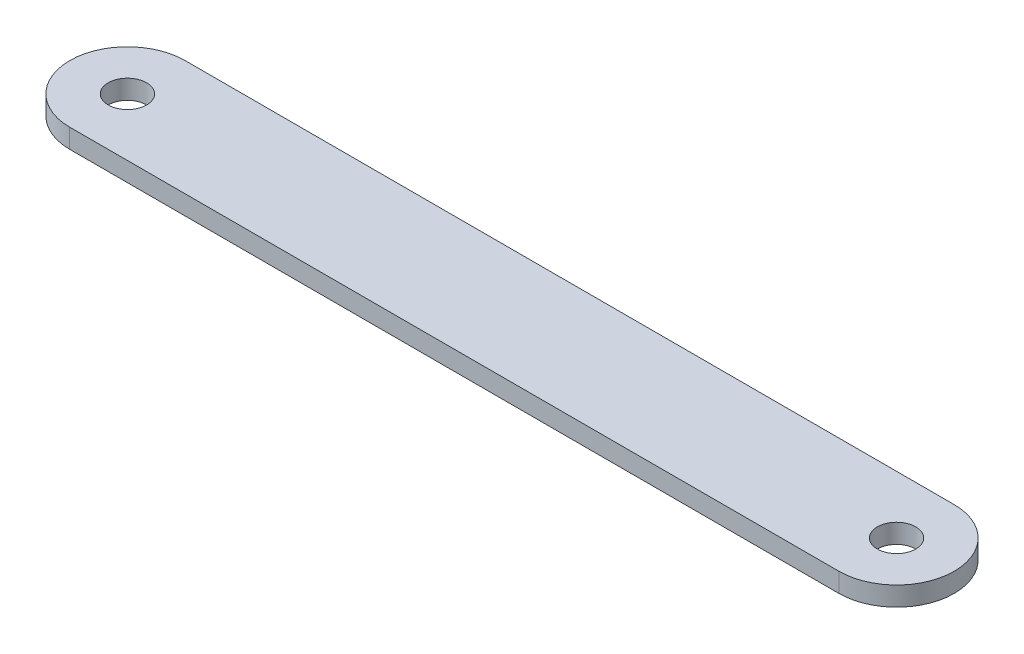
ISO-10303-21;
HEADER;
FILE_DESCRIPTION(('STEP AP214'),'2;1');
FILE_NAME('part.step','',(''),(''),'','','');
FILE_SCHEMA(('AUTOMOTIVE_DESIGN { 1 0 10303 214 1 1 1 1 }'));
ENDSEC;
DATA;
#1=APPLICATION_CONTEXT('core data for automotive mechanical design processes');
#2=APPLICATION_PROTOCOL_DEFINITION('international standard','automotive_design',2000,#1);
#3=PRODUCT_CONTEXT('',#1,'mechanical');
#4=PRODUCT('Part','Part','',(#3));
#5=PRODUCT_RELATED_PRODUCT_CATEGORY('part','',(#4));
#6=PRODUCT_DEFINITION_FORMATION('','',#4);
#7=PRODUCT_DEFINITION_CONTEXT('part definition',#1,'design');
#8=PRODUCT_DEFINITION('design','',#6,#7);
#9=PRODUCT_DEFINITION_SHAPE('','',#8);
#10=(LENGTH_UNIT() NAMED_UNIT(*) SI_UNIT(.MILLI.,.METRE.));
#11=(NAMED_UNIT(*) PLANE_ANGLE_UNIT() SI_UNIT($,.RADIAN.));
#12=(NAMED_UNIT(*) SI_UNIT($,.STERADIAN.) SOLID_ANGLE_UNIT());
#13=UNCERTAINTY_MEASURE_WITH_UNIT(LENGTH_MEASURE(1.E-05),#10,'distance_accuracy_value','');
#14=(GEOMETRIC_REPRESENTATION_CONTEXT(3) GLOBAL_UNCERTAINTY_ASSIGNED_CONTEXT((#13)) GLOBAL_UNIT_ASSIGNED_CONTEXT((#10,
#11,#12)) REPRESENTATION_CONTEXT('',''));
#15=CARTESIAN_POINT('',(0.,0.,0.));
#16=DIRECTION('',(0.,0.,1.));
#17=DIRECTION('',(1.,0.,0.));
#18=AXIS2_PLACEMENT_3D('',#15,#16,#17);
#19=CARTESIAN_POINT('',(0.,5.,0.));
#20=DIRECTION('',(0.,1.,0.));
#21=DIRECTION('',(0.,0.,1.));
#22=AXIS2_PLACEMENT_3D('',#19,#20,#21);
#23=PLANE('',#22);
#24=CARTESIAN_POINT('',(0.,5.,0.));
#25=DIRECTION('',(0.,1.,0.));
#26=DIRECTION('',(0.,0.,1.));
#27=AXIS2_PLACEMENT_3D('',#24,#25,#26);
#28=CIRCLE('',#27,5.);
#29=CARTESIAN_POINT('',(0.,5.,5.));
#30=VERTEX_POINT('',#29);
#31=EDGE_CURVE('E106',#30,#30,#28,.T.);
#32=ORIENTED_EDGE('',*,*,#31,.F.);
#33=EDGE_LOOP('',(#32));
#34=FACE_BOUND('',#33,.T.);
#35=CARTESIAN_POINT('',(0.,5.,0.));
#36=DIRECTION('',(0.,1.,0.));
#37=DIRECTION('',(0.,0.,1.));
#38=AXIS2_PLACEMENT_3D('',#35,#36,#37);
#39=CIRCLE('',#38,15.);
#40=CARTESIAN_POINT('',(0.,5.,-15.));
#41=VERTEX_POINT('',#40);
#42=CARTESIAN_POINT('',(0.,5.,15.));
#43=VERTEX_POINT('',#42);
#44=EDGE_CURVE('E91',#41,#43,#39,.T.);
#45=ORIENTED_EDGE('',*,*,#44,.T.);
#46=DIRECTION('',(1.,0.,0.));
#47=VECTOR('',#46,1.);
#48=CARTESIAN_POINT('',(0.,5.,15.));
#49=LINE('',#48,#47);
#50=CARTESIAN_POINT('',(200.,5.,15.));
#51=VERTEX_POINT('',#50);
#52=EDGE_CURVE('E86',#43,#51,#49,.T.);
#53=ORIENTED_EDGE('',*,*,#52,.T.);
#54=CARTESIAN_POINT('',(200.,5.,0.));
#55=DIRECTION('',(0.,1.,0.));
#56=DIRECTION('',(0.,0.,1.));
#57=AXIS2_PLACEMENT_3D('',#54,#55,#56);
#58=CIRCLE('',#57,15.);
#59=CARTESIAN_POINT('',(200.,5.,-15.));
#60=VERTEX_POINT('',#59);
#61=EDGE_CURVE('E89',#51,#60,#58,.T.);
#62=ORIENTED_EDGE('',*,*,#61,.T.);
#63=DIRECTION('',(-1.,0.,0.));
#64=VECTOR('',#63,1.);
#65=CARTESIAN_POINT('',(0.,5.,-15.));
#66=LINE('',#65,#64);
#67=EDGE_CURVE('E56',#60,#41,#66,.T.);
#68=ORIENTED_EDGE('',*,*,#67,.T.);
#69=EDGE_LOOP('',(#45,#53,#62,#68));
#70=FACE_BOUND('',#69,.T.);
#71=CARTESIAN_POINT('',(200.,5.,0.));
#72=DIRECTION('',(0.,1.,0.));
#73=DIRECTION('',(0.,0.,1.));
#74=AXIS2_PLACEMENT_3D('',#71,#72,#73);
#75=CIRCLE('',#74,4.99999999999999);
#76=CARTESIAN_POINT('',(200.,5.,4.99999999999999));
#77=VERTEX_POINT('',#76);
#78=EDGE_CURVE('E121',#77,#77,#75,.T.);
#79=ORIENTED_EDGE('',*,*,#78,.F.);
#80=EDGE_LOOP('',(#79));
#81=FACE_BOUND('',#80,.T.);
#82=ADVANCED_FACE('F39',(#34,#70,#81),#23,.T.);
#83=CARTESIAN_POINT('',(0.,0.,0.));
#84=DIRECTION('',(0.,1.,0.));
#85=DIRECTION('',(0.,0.,1.));
#86=AXIS2_PLACEMENT_3D('',#83,#84,#85);
#87=PLANE('',#86);
#88=CARTESIAN_POINT('',(0.,0.,0.));
#89=DIRECTION('',(0.,1.,0.));
#90=DIRECTION('',(0.,0.,1.));
#91=AXIS2_PLACEMENT_3D('',#88,#89,#90);
#92=CIRCLE('',#91,15.);
#93=CARTESIAN_POINT('',(0.,0.,-15.));
#94=VERTEX_POINT('',#93);
#95=CARTESIAN_POINT('',(0.,0.,15.));
#96=VERTEX_POINT('',#95);
#97=EDGE_CURVE('E103',#94,#96,#92,.T.);
#98=ORIENTED_EDGE('',*,*,#97,.F.);
#99=DIRECTION('',(-1.,0.,0.));
#100=VECTOR('',#99,1.);
#101=CARTESIAN_POINT('',(0.,0.,-15.));
#102=LINE('',#101,#100);
#103=CARTESIAN_POINT('',(200.,0.,-15.));
#104=VERTEX_POINT('',#103);
#105=EDGE_CURVE('E79',#104,#94,#102,.T.);
#106=ORIENTED_EDGE('',*,*,#105,.F.);
#107=CARTESIAN_POINT('',(200.,0.,0.));
#108=DIRECTION('',(0.,1.,0.));
#109=DIRECTION('',(0.,0.,1.));
#110=AXIS2_PLACEMENT_3D('',#107,#108,#109);
#111=CIRCLE('',#110,15.);
#112=CARTESIAN_POINT('',(200.,0.,15.));
#113=VERTEX_POINT('',#112);
#114=EDGE_CURVE('E73',#113,#104,#111,.T.);
#115=ORIENTED_EDGE('',*,*,#114,.F.);
#116=DIRECTION('',(1.,0.,0.));
#117=VECTOR('',#116,1.);
#118=CARTESIAN_POINT('',(0.,0.,15.));
#119=LINE('',#118,#117);
#120=EDGE_CURVE('E95',#96,#113,#119,.T.);
#121=ORIENTED_EDGE('',*,*,#120,.F.);
#122=EDGE_LOOP('',(#98,#106,#115,#121));
#123=FACE_BOUND('',#122,.T.);
#124=CARTESIAN_POINT('',(0.,0.,0.));
#125=DIRECTION('',(0.,1.,0.));
#126=DIRECTION('',(0.,0.,1.));
#127=AXIS2_PLACEMENT_3D('',#124,#125,#126);
#128=CIRCLE('',#127,5.);
#129=CARTESIAN_POINT('',(0.,0.,5.));
#130=VERTEX_POINT('',#129);
#131=EDGE_CURVE('E118',#130,#130,#128,.T.);
#132=ORIENTED_EDGE('',*,*,#131,.T.);
#133=EDGE_LOOP('',(#132));
#134=FACE_BOUND('',#133,.T.);
#135=CARTESIAN_POINT('',(200.,0.,0.));
#136=DIRECTION('',(0.,1.,0.));
#137=DIRECTION('',(0.,0.,1.));
#138=AXIS2_PLACEMENT_3D('',#135,#136,#137);
#139=CIRCLE('',#138,4.99999999999999);
#140=CARTESIAN_POINT('',(200.,0.,4.99999999999999));
#141=VERTEX_POINT('',#140);
#142=EDGE_CURVE('E124',#141,#141,#139,.T.);
#143=ORIENTED_EDGE('',*,*,#142,.T.);
#144=EDGE_LOOP('',(#143));
#145=FACE_BOUND('',#144,.T.);
#146=ADVANCED_FACE('F114',(#123,#134,#145),#87,.F.);
#147=CARTESIAN_POINT('',(0.,5.,0.));
#148=DIRECTION('',(0.,-1.,0.));
#149=DIRECTION('',(0.,0.,-1.));
#150=AXIS2_PLACEMENT_3D('',#147,#148,#149);
#151=CYLINDRICAL_SURFACE('',#150,15.);
#152=ORIENTED_EDGE('',*,*,#97,.T.);
#153=DIRECTION('',(0.,-1.,0.));
#154=VECTOR('',#153,1.);
#155=CARTESIAN_POINT('',(0.,5.,15.));
#156=LINE('',#155,#154);
#157=EDGE_CURVE('E11',#43,#96,#156,.T.);
#158=ORIENTED_EDGE('',*,*,#157,.F.);
#159=ORIENTED_EDGE('',*,*,#44,.F.);
#160=DIRECTION('',(0.,-1.,0.));
#161=VECTOR('',#160,1.);
#162=CARTESIAN_POINT('',(0.,5.,-15.));
#163=LINE('',#162,#161);
#164=EDGE_CURVE('E99',#41,#94,#163,.T.);
#165=ORIENTED_EDGE('',*,*,#164,.T.);
#166=EDGE_LOOP('',(#152,#158,#159,#165));
#167=FACE_BOUND('',#166,.T.);
#168=ADVANCED_FACE('F41',(#167),#151,.T.);
#169=CARTESIAN_POINT('',(0.,5.,15.));
#170=DIRECTION('',(0.,0.,-1.));
#171=DIRECTION('',(-1.,0.,0.));
#172=AXIS2_PLACEMENT_3D('',#169,#170,#171);
#173=PLANE('',#172);
#174=ORIENTED_EDGE('',*,*,#120,.T.);
#175=DIRECTION('',(0.,-1.,0.));
#176=VECTOR('',#175,1.);
#177=CARTESIAN_POINT('',(200.,5.,15.));
#178=LINE('',#177,#176);
#179=EDGE_CURVE('E48',#51,#113,#178,.T.);
#180=ORIENTED_EDGE('',*,*,#179,.F.);
#181=ORIENTED_EDGE('',*,*,#52,.F.);
#182=ORIENTED_EDGE('',*,*,#157,.T.);
#183=EDGE_LOOP('',(#174,#180,#181,#182));
#184=FACE_BOUND('',#183,.T.);
#185=ADVANCED_FACE('F94',(#184),#173,.F.);
#186=CARTESIAN_POINT('',(200.,5.,0.));
#187=DIRECTION('',(0.,-1.,0.));
#188=DIRECTION('',(0.,0.,-1.));
#189=AXIS2_PLACEMENT_3D('',#186,#187,#188);
#190=CYLINDRICAL_SURFACE('',#189,15.);
#191=ORIENTED_EDGE('',*,*,#114,.T.);
#192=DIRECTION('',(0.,-1.,0.));
#193=VECTOR('',#192,1.);
#194=CARTESIAN_POINT('',(200.,5.,-15.));
#195=LINE('',#194,#193);
#196=EDGE_CURVE('E96',#60,#104,#195,.T.);
#197=ORIENTED_EDGE('',*,*,#196,.F.);
#198=ORIENTED_EDGE('',*,*,#61,.F.);
#199=ORIENTED_EDGE('',*,*,#179,.T.);
#200=EDGE_LOOP('',(#191,#197,#198,#199));
#201=FACE_BOUND('',#200,.T.);
#202=ADVANCED_FACE('F97',(#201),#190,.T.);
#203=CARTESIAN_POINT('',(0.,5.,-15.));
#204=DIRECTION('',(0.,0.,1.));
#205=DIRECTION('',(1.,0.,0.));
#206=AXIS2_PLACEMENT_3D('',#203,#204,#205);
#207=PLANE('',#206);
#208=ORIENTED_EDGE('',*,*,#105,.T.);
#209=ORIENTED_EDGE('',*,*,#164,.F.);
#210=ORIENTED_EDGE('',*,*,#67,.F.);
#211=ORIENTED_EDGE('',*,*,#196,.T.);
#212=EDGE_LOOP('',(#208,#209,#210,#211));
#213=FACE_BOUND('',#212,.T.);
#214=ADVANCED_FACE('F111',(#213),#207,.F.);
#215=CARTESIAN_POINT('',(0.,5.,0.));
#216=DIRECTION('',(0.,-1.,0.));
#217=DIRECTION('',(0.,0.,-1.));
#218=AXIS2_PLACEMENT_3D('',#215,#216,#217);
#219=CYLINDRICAL_SURFACE('',#218,5.);
#220=ORIENTED_EDGE('',*,*,#31,.T.);
#221=EDGE_LOOP('',(#220));
#222=FACE_BOUND('',#221,.T.);
#223=ORIENTED_EDGE('',*,*,#131,.F.);
#224=EDGE_LOOP('',(#223));
#225=FACE_BOUND('',#224,.T.);
#226=ADVANCED_FACE('F141',(#222,#225),#219,.F.);
#227=CARTESIAN_POINT('',(200.,5.,0.));
#228=DIRECTION('',(0.,-1.,0.));
#229=DIRECTION('',(0.,0.,-1.));
#230=AXIS2_PLACEMENT_3D('',#227,#228,#229);
#231=CYLINDRICAL_SURFACE('',#230,4.99999999999999);
#232=ORIENTED_EDGE('',*,*,#78,.T.);
#233=EDGE_LOOP('',(#232));
#234=FACE_BOUND('',#233,.T.);
#235=ORIENTED_EDGE('',*,*,#142,.F.);
#236=EDGE_LOOP('',(#235));
#237=FACE_BOUND('',#236,.T.);
#238=ADVANCED_FACE('F130',(#234,#237),#231,.F.);
#239=CLOSED_SHELL('',(#82,#146,#168,#185,#202,#214,#226,#238));
#240=MANIFOLD_SOLID_BREP('B2',#239);
#241=ADVANCED_BREP_SHAPE_REPRESENTATION('',(#18,#240),#14);
#242=SHAPE_DEFINITION_REPRESENTATION(#9,#241);
ENDSEC;
END-ISO-10303-21;
